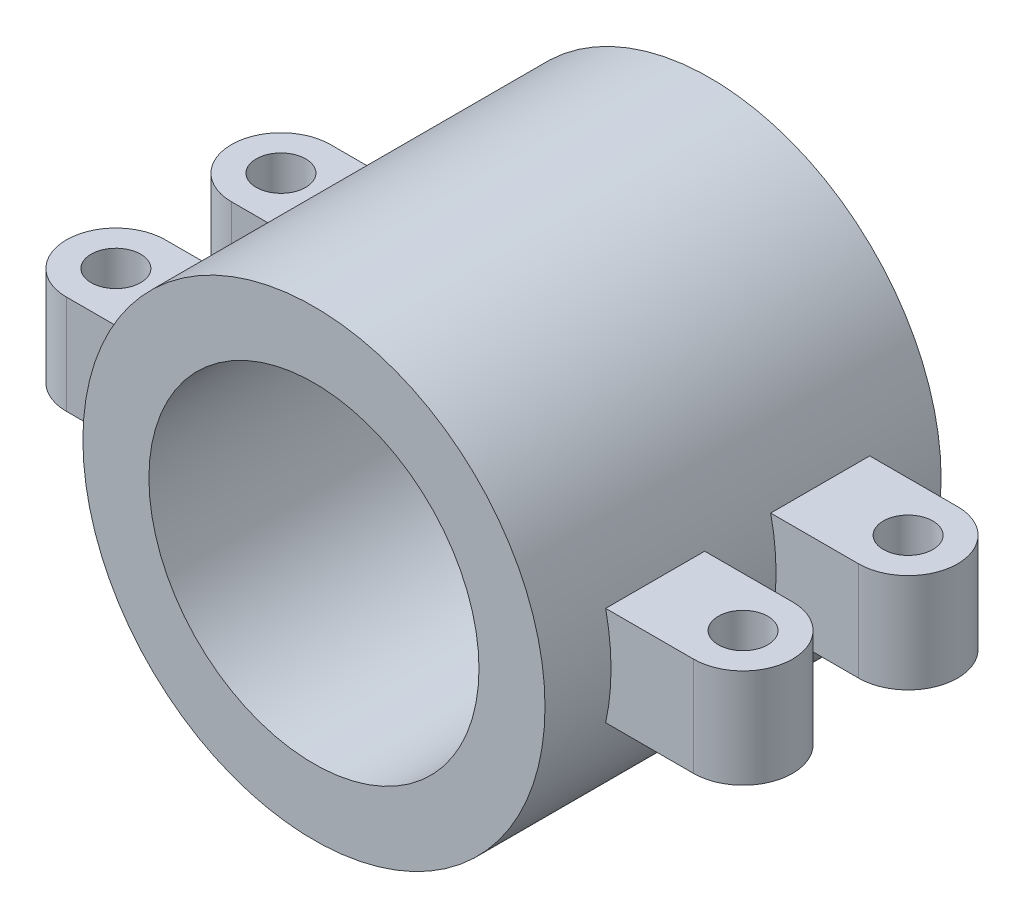
ISO-10303-21;
HEADER;
FILE_DESCRIPTION(('STEP AP214'),'2;1');
FILE_NAME('part.step','',(''),(''),'','','');
FILE_SCHEMA(('AUTOMOTIVE_DESIGN { 1 0 10303 214 1 1 1 1 }'));
ENDSEC;
DATA;
#1=APPLICATION_CONTEXT('core data for automotive mechanical design processes');
#2=APPLICATION_PROTOCOL_DEFINITION('international standard','automotive_design',2000,#1);
#3=PRODUCT_CONTEXT('',#1,'mechanical');
#4=PRODUCT('Part','Part','',(#3));
#5=PRODUCT_RELATED_PRODUCT_CATEGORY('part','',(#4));
#6=PRODUCT_DEFINITION_FORMATION('','',#4);
#7=PRODUCT_DEFINITION_CONTEXT('part definition',#1,'design');
#8=PRODUCT_DEFINITION('design','',#6,#7);
#9=PRODUCT_DEFINITION_SHAPE('','',#8);
#10=(LENGTH_UNIT() NAMED_UNIT(*) SI_UNIT(.MILLI.,.METRE.));
#11=(NAMED_UNIT(*) PLANE_ANGLE_UNIT() SI_UNIT($,.RADIAN.));
#12=(NAMED_UNIT(*) SI_UNIT($,.STERADIAN.) SOLID_ANGLE_UNIT());
#13=UNCERTAINTY_MEASURE_WITH_UNIT(LENGTH_MEASURE(1.E-05),#10,'distance_accuracy_value','');
#14=(GEOMETRIC_REPRESENTATION_CONTEXT(3) GLOBAL_UNCERTAINTY_ASSIGNED_CONTEXT((#13)) GLOBAL_UNIT_ASSIGNED_CONTEXT((#10,
#11,#12)) REPRESENTATION_CONTEXT('',''));
#15=CARTESIAN_POINT('',(0.,0.,0.));
#16=DIRECTION('',(0.,0.,1.));
#17=DIRECTION('',(1.,0.,0.));
#18=AXIS2_PLACEMENT_3D('',#15,#16,#17);
#19=CARTESIAN_POINT('',(0.,0.,120.));
#20=DIRECTION('',(0.,0.,-1.));
#21=DIRECTION('',(-1.,0.,0.));
#22=AXIS2_PLACEMENT_3D('',#19,#20,#21);
#23=CYLINDRICAL_SURFACE('',#22,70.);
#24=DIRECTION('',(0.,0.,-1.));
#25=VECTOR('',#24,1.);
#26=CARTESIAN_POINT('',(68.3739716558867,15.,120.));
#27=LINE('',#26,#25);
#28=CARTESIAN_POINT('',(68.3739716558867,15.,70.));
#29=VERTEX_POINT('',#28);
#30=CARTESIAN_POINT('',(68.3739716558867,15.,100.));
#31=VERTEX_POINT('',#30);
#32=EDGE_CURVE('E199',#29,#31,#27,.F.);
#33=ORIENTED_EDGE('',*,*,#32,.F.);
#34=CARTESIAN_POINT('',(0.,0.,70.));
#35=DIRECTION('',(0.,0.,1.));
#36=DIRECTION('',(1.,0.,0.));
#37=AXIS2_PLACEMENT_3D('',#34,#35,#36);
#38=CIRCLE('',#37,70.);
#39=CARTESIAN_POINT('',(68.3739716558867,-15.,70.));
#40=VERTEX_POINT('',#39);
#41=EDGE_CURVE('E205',#40,#29,#38,.T.);
#42=ORIENTED_EDGE('',*,*,#41,.F.);
#43=DIRECTION('',(0.,0.,-1.));
#44=VECTOR('',#43,1.);
#45=CARTESIAN_POINT('',(68.3739716558867,-15.,120.));
#46=LINE('',#45,#44);
#47=CARTESIAN_POINT('',(68.3739716558867,-15.,100.));
#48=VERTEX_POINT('',#47);
#49=EDGE_CURVE('E183',#40,#48,#46,.F.);
#50=ORIENTED_EDGE('',*,*,#49,.T.);
#51=CARTESIAN_POINT('',(0.,0.,100.));
#52=DIRECTION('',(0.,0.,-1.));
#53=DIRECTION('',(-1.,0.,0.));
#54=AXIS2_PLACEMENT_3D('',#51,#52,#53);
#55=CIRCLE('',#54,70.);
#56=EDGE_CURVE('E211',#31,#48,#55,.T.);
#57=ORIENTED_EDGE('',*,*,#56,.F.);
#58=EDGE_LOOP('',(#33,#42,#50,#57));
#59=FACE_BOUND('',#58,.T.);
#60=CARTESIAN_POINT('',(0.,0.,50.));
#61=DIRECTION('',(0.,0.,-1.));
#62=DIRECTION('',(-1.,0.,0.));
#63=AXIS2_PLACEMENT_3D('',#60,#61,#62);
#64=CIRCLE('',#63,70.);
#65=CARTESIAN_POINT('',(68.3739716558867,15.,50.));
#66=VERTEX_POINT('',#65);
#67=CARTESIAN_POINT('',(68.3739716558867,-15.,50.));
#68=VERTEX_POINT('',#67);
#69=EDGE_CURVE('E285',#66,#68,#64,.T.);
#70=ORIENTED_EDGE('',*,*,#69,.F.);
#71=DIRECTION('',(0.,0.,-1.));
#72=VECTOR('',#71,1.);
#73=CARTESIAN_POINT('',(68.3739716558867,15.,120.));
#74=LINE('',#73,#72);
#75=CARTESIAN_POINT('',(68.3739716558867,15.,20.));
#76=VERTEX_POINT('',#75);
#77=EDGE_CURVE('E273',#66,#76,#74,.T.);
#78=ORIENTED_EDGE('',*,*,#77,.T.);
#79=CARTESIAN_POINT('',(0.,0.,20.));
#80=DIRECTION('',(0.,0.,1.));
#81=DIRECTION('',(1.,0.,0.));
#82=AXIS2_PLACEMENT_3D('',#79,#80,#81);
#83=CIRCLE('',#82,70.);
#84=CARTESIAN_POINT('',(68.3739716558867,-15.,20.));
#85=VERTEX_POINT('',#84);
#86=EDGE_CURVE('E276',#85,#76,#83,.T.);
#87=ORIENTED_EDGE('',*,*,#86,.F.);
#88=DIRECTION('',(0.,0.,-1.));
#89=VECTOR('',#88,1.);
#90=CARTESIAN_POINT('',(68.3739716558867,-15.,120.));
#91=LINE('',#90,#89);
#92=EDGE_CURVE('E266',#68,#85,#91,.T.);
#93=ORIENTED_EDGE('',*,*,#92,.F.);
#94=EDGE_LOOP('',(#70,#78,#87,#93));
#95=FACE_BOUND('',#94,.T.);
#96=CARTESIAN_POINT('',(-68.3739716558867,15.,20.));
#97=VERTEX_POINT('',#96);
#98=CARTESIAN_POINT('',(-68.3739716558867,-15.,20.));
#99=VERTEX_POINT('',#98);
#100=EDGE_CURVE('E280',#97,#99,#83,.T.);
#101=ORIENTED_EDGE('',*,*,#100,.F.);
#102=DIRECTION('',(0.,0.,-1.));
#103=VECTOR('',#102,1.);
#104=CARTESIAN_POINT('',(-68.3739716558867,15.,120.));
#105=LINE('',#104,#103);
#106=CARTESIAN_POINT('',(-68.3739716558867,15.,50.));
#107=VERTEX_POINT('',#106);
#108=EDGE_CURVE('E270',#97,#107,#105,.F.);
#109=ORIENTED_EDGE('',*,*,#108,.T.);
#110=CARTESIAN_POINT('',(-68.3739716558867,-15.,50.));
#111=VERTEX_POINT('',#110);
#112=EDGE_CURVE('E281',#111,#107,#64,.T.);
#113=ORIENTED_EDGE('',*,*,#112,.F.);
#114=DIRECTION('',(0.,0.,-1.));
#115=VECTOR('',#114,1.);
#116=CARTESIAN_POINT('',(-68.3739716558867,-15.,120.));
#117=LINE('',#116,#115);
#118=EDGE_CURVE('E262',#99,#111,#117,.F.);
#119=ORIENTED_EDGE('',*,*,#118,.F.);
#120=EDGE_LOOP('',(#101,#109,#113,#119));
#121=FACE_BOUND('',#120,.T.);
#122=CARTESIAN_POINT('',(0.,0.,120.));
#123=DIRECTION('',(0.,0.,1.));
#124=DIRECTION('',(1.,0.,0.));
#125=AXIS2_PLACEMENT_3D('',#122,#123,#124);
#126=CIRCLE('',#125,70.);
#127=CARTESIAN_POINT('',(70.,0.,120.));
#128=VERTEX_POINT('',#127);
#129=EDGE_CURVE('E11',#128,#128,#126,.T.);
#130=ORIENTED_EDGE('',*,*,#129,.F.);
#131=EDGE_LOOP('',(#130));
#132=FACE_BOUND('',#131,.T.);
#133=CARTESIAN_POINT('',(0.,0.,0.));
#134=DIRECTION('',(0.,0.,1.));
#135=DIRECTION('',(1.,0.,0.));
#136=AXIS2_PLACEMENT_3D('',#133,#134,#135);
#137=CIRCLE('',#136,70.);
#138=CARTESIAN_POINT('',(70.,0.,0.));
#139=VERTEX_POINT('',#138);
#140=EDGE_CURVE('E48',#139,#139,#137,.T.);
#141=ORIENTED_EDGE('',*,*,#140,.T.);
#142=EDGE_LOOP('',(#141));
#143=FACE_BOUND('',#142,.T.);
#144=DIRECTION('',(0.,0.,-1.));
#145=VECTOR('',#144,1.);
#146=CARTESIAN_POINT('',(-68.3739716558867,15.,120.));
#147=LINE('',#146,#145);
#148=CARTESIAN_POINT('',(-68.3739716558867,15.,100.));
#149=VERTEX_POINT('',#148);
#150=CARTESIAN_POINT('',(-68.3739716558867,15.,70.));
#151=VERTEX_POINT('',#150);
#152=EDGE_CURVE('E202',#149,#151,#147,.T.);
#153=ORIENTED_EDGE('',*,*,#152,.F.);
#154=CARTESIAN_POINT('',(-68.3739716558867,-15.,100.));
#155=VERTEX_POINT('',#154);
#156=EDGE_CURVE('E162',#155,#149,#55,.T.);
#157=ORIENTED_EDGE('',*,*,#156,.F.);
#158=DIRECTION('',(0.,0.,-1.));
#159=VECTOR('',#158,1.);
#160=CARTESIAN_POINT('',(-68.3739716558867,-15.,120.));
#161=LINE('',#160,#159);
#162=CARTESIAN_POINT('',(-68.3739716558867,-15.,70.));
#163=VERTEX_POINT('',#162);
#164=EDGE_CURVE('E189',#155,#163,#161,.T.);
#165=ORIENTED_EDGE('',*,*,#164,.T.);
#166=EDGE_CURVE('E208',#151,#163,#38,.T.);
#167=ORIENTED_EDGE('',*,*,#166,.F.);
#168=EDGE_LOOP('',(#153,#157,#165,#167));
#169=FACE_BOUND('',#168,.T.);
#170=ADVANCED_FACE('F39',(#59,#95,#121,#132,#143,#169),#23,.T.);
#171=CARTESIAN_POINT('',(0.,0.,120.));
#172=DIRECTION('',(0.,0.,-1.));
#173=DIRECTION('',(-1.,0.,0.));
#174=AXIS2_PLACEMENT_3D('',#171,#172,#173);
#175=CYLINDRICAL_SURFACE('',#174,50.);
#176=CARTESIAN_POINT('',(0.,0.,120.));
#177=DIRECTION('',(0.,0.,1.));
#178=DIRECTION('',(1.,0.,0.));
#179=AXIS2_PLACEMENT_3D('',#176,#177,#178);
#180=CIRCLE('',#179,50.);
#181=CARTESIAN_POINT('',(50.,0.,120.));
#182=VERTEX_POINT('',#181);
#183=EDGE_CURVE('E286',#182,#182,#180,.T.);
#184=ORIENTED_EDGE('',*,*,#183,.T.);
#185=EDGE_LOOP('',(#184));
#186=FACE_BOUND('',#185,.T.);
#187=CARTESIAN_POINT('',(0.,0.,0.));
#188=DIRECTION('',(0.,0.,1.));
#189=DIRECTION('',(1.,0.,0.));
#190=AXIS2_PLACEMENT_3D('',#187,#188,#189);
#191=CIRCLE('',#190,50.);
#192=CARTESIAN_POINT('',(50.,0.,0.));
#193=VERTEX_POINT('',#192);
#194=EDGE_CURVE('E290',#193,#193,#191,.T.);
#195=ORIENTED_EDGE('',*,*,#194,.F.);
#196=EDGE_LOOP('',(#195));
#197=FACE_BOUND('',#196,.T.);
#198=ADVANCED_FACE('F416',(#186,#197),#175,.F.);
#199=CARTESIAN_POINT('',(0.,0.,120.));
#200=DIRECTION('',(0.,0.,1.));
#201=DIRECTION('',(1.,0.,0.));
#202=AXIS2_PLACEMENT_3D('',#199,#200,#201);
#203=PLANE('',#202);
#204=ORIENTED_EDGE('',*,*,#183,.F.);
#205=EDGE_LOOP('',(#204));
#206=FACE_BOUND('',#205,.T.);
#207=ORIENTED_EDGE('',*,*,#129,.T.);
#208=EDGE_LOOP('',(#207));
#209=FACE_BOUND('',#208,.T.);
#210=ADVANCED_FACE('F420',(#206,#209),#203,.T.);
#211=CARTESIAN_POINT('',(0.,0.,0.));
#212=DIRECTION('',(0.,0.,1.));
#213=DIRECTION('',(1.,0.,0.));
#214=AXIS2_PLACEMENT_3D('',#211,#212,#213);
#215=PLANE('',#214);
#216=ORIENTED_EDGE('',*,*,#194,.T.);
#217=EDGE_LOOP('',(#216));
#218=FACE_BOUND('',#217,.T.);
#219=ORIENTED_EDGE('',*,*,#140,.F.);
#220=EDGE_LOOP('',(#219));
#221=FACE_BOUND('',#220,.T.);
#222=ADVANCED_FACE('F426',(#218,#221),#215,.F.);
#223=CARTESIAN_POINT('',(-95.,15.,35.));
#224=DIRECTION('',(0.,-1.,0.));
#225=DIRECTION('',(0.,0.,-1.));
#226=AXIS2_PLACEMENT_3D('',#223,#224,#225);
#227=CYLINDRICAL_SURFACE('',#226,15.);
#228=CARTESIAN_POINT('',(-95.,-15.,35.));
#229=DIRECTION('',(0.,1.,0.));
#230=DIRECTION('',(0.,0.,1.));
#231=AXIS2_PLACEMENT_3D('',#228,#229,#230);
#232=CIRCLE('',#231,15.);
#233=CARTESIAN_POINT('',(-95.,-15.,20.));
#234=VERTEX_POINT('',#233);
#235=CARTESIAN_POINT('',(-95.,-15.,50.));
#236=VERTEX_POINT('',#235);
#237=EDGE_CURVE('E231',#234,#236,#232,.T.);
#238=ORIENTED_EDGE('',*,*,#237,.T.);
#239=DIRECTION('',(0.,-1.,0.));
#240=VECTOR('',#239,1.);
#241=CARTESIAN_POINT('',(-95.,15.,50.));
#242=LINE('',#241,#240);
#243=CARTESIAN_POINT('',(-95.,15.,50.));
#244=VERTEX_POINT('',#243);
#245=EDGE_CURVE('E258',#244,#236,#242,.T.);
#246=ORIENTED_EDGE('',*,*,#245,.F.);
#247=CARTESIAN_POINT('',(-95.,15.,35.));
#248=DIRECTION('',(0.,1.,0.));
#249=DIRECTION('',(0.,0.,1.));
#250=AXIS2_PLACEMENT_3D('',#247,#248,#249);
#251=CIRCLE('',#250,15.);
#252=CARTESIAN_POINT('',(-95.,15.,20.));
#253=VERTEX_POINT('',#252);
#254=EDGE_CURVE('E212',#253,#244,#251,.T.);
#255=ORIENTED_EDGE('',*,*,#254,.F.);
#256=DIRECTION('',(0.,-1.,0.));
#257=VECTOR('',#256,1.);
#258=CARTESIAN_POINT('',(-95.,15.,20.));
#259=LINE('',#258,#257);
#260=EDGE_CURVE('E230',#253,#234,#259,.T.);
#261=ORIENTED_EDGE('',*,*,#260,.T.);
#262=EDGE_LOOP('',(#238,#246,#255,#261));
#263=FACE_BOUND('',#262,.T.);
#264=ADVANCED_FACE('F431',(#263),#227,.T.);
#265=CARTESIAN_POINT('',(-95.,-15.,35.));
#266=DIRECTION('',(0.,1.,0.));
#267=DIRECTION('',(0.,0.,1.));
#268=AXIS2_PLACEMENT_3D('',#265,#266,#267);
#269=PLANE('',#268);
#270=CARTESIAN_POINT('',(-95.,-15.,35.));
#271=DIRECTION('',(0.,1.,0.));
#272=DIRECTION('',(0.,0.,1.));
#273=AXIS2_PLACEMENT_3D('',#270,#271,#272);
#274=CIRCLE('',#273,7.50000000000001);
#275=CARTESIAN_POINT('',(-95.,-15.,42.5));
#276=VERTEX_POINT('',#275);
#277=EDGE_CURVE('E322',#276,#276,#274,.T.);
#278=ORIENTED_EDGE('',*,*,#277,.T.);
#279=EDGE_LOOP('',(#278));
#280=FACE_BOUND('',#279,.T.);
#281=DIRECTION('',(-1.,0.,0.));
#282=VECTOR('',#281,1.);
#283=CARTESIAN_POINT('',(-95.,-15.,20.));
#284=LINE('',#283,#282);
#285=EDGE_CURVE('E243',#99,#234,#284,.T.);
#286=ORIENTED_EDGE('',*,*,#285,.F.);
#287=ORIENTED_EDGE('',*,*,#118,.T.);
#288=DIRECTION('',(1.,0.,0.));
#289=VECTOR('',#288,1.);
#290=CARTESIAN_POINT('',(-95.,-15.,50.));
#291=LINE('',#290,#289);
#292=EDGE_CURVE('E236',#236,#111,#291,.T.);
#293=ORIENTED_EDGE('',*,*,#292,.F.);
#294=ORIENTED_EDGE('',*,*,#237,.F.);
#295=EDGE_LOOP('',(#286,#287,#293,#294));
#296=FACE_BOUND('',#295,.T.);
#297=ADVANCED_FACE('F379',(#280,#296),#269,.F.);
#298=CARTESIAN_POINT('',(-95.,15.,35.));
#299=DIRECTION('',(0.,1.,0.));
#300=DIRECTION('',(0.,0.,1.));
#301=AXIS2_PLACEMENT_3D('',#298,#299,#300);
#302=PLANE('',#301);
#303=CARTESIAN_POINT('',(-95.,15.,35.));
#304=DIRECTION('',(0.,1.,0.));
#305=DIRECTION('',(0.,0.,1.));
#306=AXIS2_PLACEMENT_3D('',#303,#304,#305);
#307=CIRCLE('',#306,7.50000000000001);
#308=CARTESIAN_POINT('',(-95.,15.,42.5));
#309=VERTEX_POINT('',#308);
#310=EDGE_CURVE('E42',#309,#309,#307,.T.);
#311=ORIENTED_EDGE('',*,*,#310,.F.);
#312=EDGE_LOOP('',(#311));
#313=FACE_BOUND('',#312,.T.);
#314=ORIENTED_EDGE('',*,*,#108,.F.);
#315=DIRECTION('',(-1.,0.,0.));
#316=VECTOR('',#315,1.);
#317=CARTESIAN_POINT('',(-95.,15.,20.));
#318=LINE('',#317,#316);
#319=EDGE_CURVE('E225',#97,#253,#318,.T.);
#320=ORIENTED_EDGE('',*,*,#319,.T.);
#321=ORIENTED_EDGE('',*,*,#254,.T.);
#322=DIRECTION('',(1.,0.,0.));
#323=VECTOR('',#322,1.);
#324=CARTESIAN_POINT('',(-95.,15.,50.));
#325=LINE('',#324,#323);
#326=EDGE_CURVE('E218',#244,#107,#325,.T.);
#327=ORIENTED_EDGE('',*,*,#326,.T.);
#328=EDGE_LOOP('',(#314,#320,#321,#327));
#329=FACE_BOUND('',#328,.T.);
#330=ADVANCED_FACE('F375',(#313,#329),#302,.T.);
#331=CARTESIAN_POINT('',(-95.,15.,20.));
#332=DIRECTION('',(0.,0.,1.));
#333=DIRECTION('',(1.,0.,0.));
#334=AXIS2_PLACEMENT_3D('',#331,#332,#333);
#335=PLANE('',#334);
#336=ORIENTED_EDGE('',*,*,#319,.F.);
#337=ORIENTED_EDGE('',*,*,#100,.T.);
#338=ORIENTED_EDGE('',*,*,#285,.T.);
#339=ORIENTED_EDGE('',*,*,#260,.F.);
#340=EDGE_LOOP('',(#336,#337,#338,#339));
#341=FACE_BOUND('',#340,.T.);
#342=ADVANCED_FACE('F378',(#341),#335,.F.);
#343=CARTESIAN_POINT('',(-95.,15.,50.));
#344=DIRECTION('',(0.,0.,-1.));
#345=DIRECTION('',(-1.,0.,0.));
#346=AXIS2_PLACEMENT_3D('',#343,#344,#345);
#347=PLANE('',#346);
#348=ORIENTED_EDGE('',*,*,#292,.T.);
#349=ORIENTED_EDGE('',*,*,#112,.T.);
#350=ORIENTED_EDGE('',*,*,#326,.F.);
#351=ORIENTED_EDGE('',*,*,#245,.T.);
#352=EDGE_LOOP('',(#348,#349,#350,#351));
#353=FACE_BOUND('',#352,.T.);
#354=ADVANCED_FACE('F453',(#353),#347,.F.);
#355=CARTESIAN_POINT('',(95.,15.,50.));
#356=VERTEX_POINT('',#355);
#357=EDGE_CURVE('E216',#66,#356,#325,.T.);
#358=ORIENTED_EDGE('',*,*,#357,.F.);
#359=ORIENTED_EDGE('',*,*,#69,.T.);
#360=CARTESIAN_POINT('',(95.,-15.,50.));
#361=VERTEX_POINT('',#360);
#362=EDGE_CURVE('E235',#68,#361,#291,.T.);
#363=ORIENTED_EDGE('',*,*,#362,.T.);
#364=DIRECTION('',(0.,-1.,0.));
#365=VECTOR('',#364,1.);
#366=CARTESIAN_POINT('',(95.,15.,50.));
#367=LINE('',#366,#365);
#368=EDGE_CURVE('E254',#356,#361,#367,.T.);
#369=ORIENTED_EDGE('',*,*,#368,.F.);
#370=EDGE_LOOP('',(#358,#359,#363,#369));
#371=FACE_BOUND('',#370,.T.);
#372=ADVANCED_FACE('F461',(#371),#347,.F.);
#373=CARTESIAN_POINT('',(95.,15.,35.));
#374=DIRECTION('',(0.,1.,0.));
#375=DIRECTION('',(0.,0.,1.));
#376=AXIS2_PLACEMENT_3D('',#373,#374,#375);
#377=CIRCLE('',#376,7.50000000000001);
#378=CARTESIAN_POINT('',(95.,15.,42.5));
#379=VERTEX_POINT('',#378);
#380=EDGE_CURVE('E309',#379,#379,#377,.T.);
#381=ORIENTED_EDGE('',*,*,#380,.F.);
#382=EDGE_LOOP('',(#381));
#383=FACE_BOUND('',#382,.T.);
#384=ORIENTED_EDGE('',*,*,#77,.F.);
#385=ORIENTED_EDGE('',*,*,#357,.T.);
#386=CARTESIAN_POINT('',(95.,15.,35.));
#387=DIRECTION('',(0.,1.,0.));
#388=DIRECTION('',(0.,0.,1.));
#389=AXIS2_PLACEMENT_3D('',#386,#387,#388);
#390=CIRCLE('',#389,15.);
#391=CARTESIAN_POINT('',(95.,15.,20.));
#392=VERTEX_POINT('',#391);
#393=EDGE_CURVE('E222',#356,#392,#390,.T.);
#394=ORIENTED_EDGE('',*,*,#393,.T.);
#395=EDGE_CURVE('E226',#392,#76,#318,.T.);
#396=ORIENTED_EDGE('',*,*,#395,.T.);
#397=EDGE_LOOP('',(#384,#385,#394,#396));
#398=FACE_BOUND('',#397,.T.);
#399=ADVANCED_FACE('F381',(#383,#398),#302,.T.);
#400=CARTESIAN_POINT('',(95.,-15.,35.));
#401=DIRECTION('',(0.,1.,0.));
#402=DIRECTION('',(0.,0.,1.));
#403=AXIS2_PLACEMENT_3D('',#400,#401,#402);
#404=CIRCLE('',#403,7.50000000000001);
#405=CARTESIAN_POINT('',(95.,-15.,42.5));
#406=VERTEX_POINT('',#405);
#407=EDGE_CURVE('E306',#406,#406,#404,.T.);
#408=ORIENTED_EDGE('',*,*,#407,.T.);
#409=EDGE_LOOP('',(#408));
#410=FACE_BOUND('',#409,.T.);
#411=ORIENTED_EDGE('',*,*,#362,.F.);
#412=ORIENTED_EDGE('',*,*,#92,.T.);
#413=CARTESIAN_POINT('',(95.,-15.,20.));
#414=VERTEX_POINT('',#413);
#415=EDGE_CURVE('E217',#414,#85,#284,.T.);
#416=ORIENTED_EDGE('',*,*,#415,.F.);
#417=CARTESIAN_POINT('',(95.,-15.,35.));
#418=DIRECTION('',(0.,1.,0.));
#419=DIRECTION('',(0.,0.,1.));
#420=AXIS2_PLACEMENT_3D('',#417,#418,#419);
#421=CIRCLE('',#420,15.);
#422=EDGE_CURVE('E240',#361,#414,#421,.T.);
#423=ORIENTED_EDGE('',*,*,#422,.F.);
#424=EDGE_LOOP('',(#411,#412,#416,#423));
#425=FACE_BOUND('',#424,.T.);
#426=ADVANCED_FACE('F448',(#410,#425),#269,.F.);
#427=CARTESIAN_POINT('',(95.,15.,35.));
#428=DIRECTION('',(0.,-1.,0.));
#429=DIRECTION('',(0.,0.,-1.));
#430=AXIS2_PLACEMENT_3D('',#427,#428,#429);
#431=CYLINDRICAL_SURFACE('',#430,15.);
#432=ORIENTED_EDGE('',*,*,#422,.T.);
#433=DIRECTION('',(0.,-1.,0.));
#434=VECTOR('',#433,1.);
#435=CARTESIAN_POINT('',(95.,15.,20.));
#436=LINE('',#435,#434);
#437=EDGE_CURVE('E250',#392,#414,#436,.T.);
#438=ORIENTED_EDGE('',*,*,#437,.F.);
#439=ORIENTED_EDGE('',*,*,#393,.F.);
#440=ORIENTED_EDGE('',*,*,#368,.T.);
#441=EDGE_LOOP('',(#432,#438,#439,#440));
#442=FACE_BOUND('',#441,.T.);
#443=ADVANCED_FACE('F469',(#442),#431,.T.);
#444=ORIENTED_EDGE('',*,*,#415,.T.);
#445=ORIENTED_EDGE('',*,*,#86,.T.);
#446=ORIENTED_EDGE('',*,*,#395,.F.);
#447=ORIENTED_EDGE('',*,*,#437,.T.);
#448=EDGE_LOOP('',(#444,#445,#446,#447));
#449=FACE_BOUND('',#448,.T.);
#450=ADVANCED_FACE('F473',(#449),#335,.F.);
#451=CARTESIAN_POINT('',(95.,15.,85.));
#452=DIRECTION('',(0.,-1.,0.));
#453=DIRECTION('',(0.,0.,-1.));
#454=AXIS2_PLACEMENT_3D('',#451,#452,#453);
#455=CYLINDRICAL_SURFACE('',#454,15.);
#456=CARTESIAN_POINT('',(95.,-15.,85.));
#457=DIRECTION('',(0.,1.,0.));
#458=DIRECTION('',(0.,0.,-1.));
#459=AXIS2_PLACEMENT_3D('',#456,#457,#458);
#460=CIRCLE('',#459,15.);
#461=CARTESIAN_POINT('',(95.,-15.,100.));
#462=VERTEX_POINT('',#461);
#463=CARTESIAN_POINT('',(95.,-15.,70.));
#464=VERTEX_POINT('',#463);
#465=EDGE_CURVE('E338',#462,#464,#460,.T.);
#466=ORIENTED_EDGE('',*,*,#465,.T.);
#467=DIRECTION('',(0.,-1.,0.));
#468=VECTOR('',#467,1.);
#469=CARTESIAN_POINT('',(95.,15.,70.));
#470=LINE('',#469,#468);
#471=CARTESIAN_POINT('',(95.,15.,70.));
#472=VERTEX_POINT('',#471);
#473=EDGE_CURVE('E192',#472,#464,#470,.T.);
#474=ORIENTED_EDGE('',*,*,#473,.F.);
#475=CARTESIAN_POINT('',(95.,15.,85.));
#476=DIRECTION('',(0.,1.,0.));
#477=DIRECTION('',(0.,0.,-1.));
#478=AXIS2_PLACEMENT_3D('',#475,#476,#477);
#479=CIRCLE('',#478,15.);
#480=CARTESIAN_POINT('',(95.,15.,100.));
#481=VERTEX_POINT('',#480);
#482=EDGE_CURVE('E166',#481,#472,#479,.T.);
#483=ORIENTED_EDGE('',*,*,#482,.F.);
#484=DIRECTION('',(0.,-1.,0.));
#485=VECTOR('',#484,1.);
#486=CARTESIAN_POINT('',(95.,15.,100.));
#487=LINE('',#486,#485);
#488=EDGE_CURVE('E184',#481,#462,#487,.T.);
#489=ORIENTED_EDGE('',*,*,#488,.T.);
#490=EDGE_LOOP('',(#466,#474,#483,#489));
#491=FACE_BOUND('',#490,.T.);
#492=ADVANCED_FACE('F364',(#491),#455,.T.);
#493=CARTESIAN_POINT('',(-95.,15.,85.));
#494=DIRECTION('',(0.,-1.,0.));
#495=DIRECTION('',(0.,0.,-1.));
#496=AXIS2_PLACEMENT_3D('',#493,#494,#495);
#497=PLANE('',#496);
#498=CARTESIAN_POINT('',(95.,15.,85.));
#499=DIRECTION('',(0.,-1.,0.));
#500=DIRECTION('',(0.,0.,-1.));
#501=AXIS2_PLACEMENT_3D('',#498,#499,#500);
#502=CIRCLE('',#501,7.50000000000001);
#503=CARTESIAN_POINT('',(95.,15.,77.5));
#504=VERTEX_POINT('',#503);
#505=EDGE_CURVE('E305',#504,#504,#502,.T.);
#506=ORIENTED_EDGE('',*,*,#505,.T.);
#507=EDGE_LOOP('',(#506));
#508=FACE_BOUND('',#507,.T.);
#509=DIRECTION('',(-1.,0.,0.));
#510=VECTOR('',#509,1.);
#511=CARTESIAN_POINT('',(-95.,15.,70.));
#512=LINE('',#511,#510);
#513=EDGE_CURVE('E328',#472,#29,#512,.T.);
#514=ORIENTED_EDGE('',*,*,#513,.T.);
#515=ORIENTED_EDGE('',*,*,#32,.T.);
#516=DIRECTION('',(1.,0.,0.));
#517=VECTOR('',#516,1.);
#518=CARTESIAN_POINT('',(-95.,15.,100.));
#519=LINE('',#518,#517);
#520=EDGE_CURVE('E167',#31,#481,#519,.T.);
#521=ORIENTED_EDGE('',*,*,#520,.T.);
#522=ORIENTED_EDGE('',*,*,#482,.T.);
#523=EDGE_LOOP('',(#514,#515,#521,#522));
#524=FACE_BOUND('',#523,.T.);
#525=ADVANCED_FACE('F361',(#508,#524),#497,.F.);
#526=CARTESIAN_POINT('',(-95.,-15.,85.));
#527=DIRECTION('',(0.,-1.,0.));
#528=DIRECTION('',(0.,0.,-1.));
#529=AXIS2_PLACEMENT_3D('',#526,#527,#528);
#530=PLANE('',#529);
#531=CARTESIAN_POINT('',(95.,-15.,85.));
#532=DIRECTION('',(0.,-1.,0.));
#533=DIRECTION('',(0.,0.,-1.));
#534=AXIS2_PLACEMENT_3D('',#531,#532,#533);
#535=CIRCLE('',#534,7.50000000000001);
#536=CARTESIAN_POINT('',(95.,-15.,77.5));
#537=VERTEX_POINT('',#536);
#538=EDGE_CURVE('E302',#537,#537,#535,.T.);
#539=ORIENTED_EDGE('',*,*,#538,.F.);
#540=EDGE_LOOP('',(#539));
#541=FACE_BOUND('',#540,.T.);
#542=ORIENTED_EDGE('',*,*,#49,.F.);
#543=DIRECTION('',(-1.,0.,0.));
#544=VECTOR('',#543,1.);
#545=CARTESIAN_POINT('',(-95.,-15.,70.));
#546=LINE('',#545,#544);
#547=EDGE_CURVE('E178',#464,#40,#546,.T.);
#548=ORIENTED_EDGE('',*,*,#547,.F.);
#549=ORIENTED_EDGE('',*,*,#465,.F.);
#550=DIRECTION('',(1.,0.,0.));
#551=VECTOR('',#550,1.);
#552=CARTESIAN_POINT('',(-95.,-15.,100.));
#553=LINE('',#552,#551);
#554=EDGE_CURVE('E64',#48,#462,#553,.T.);
#555=ORIENTED_EDGE('',*,*,#554,.F.);
#556=EDGE_LOOP('',(#542,#548,#549,#555));
#557=FACE_BOUND('',#556,.T.);
#558=ADVANCED_FACE('F355',(#541,#557),#530,.T.);
#559=CARTESIAN_POINT('',(-95.,15.,70.));
#560=DIRECTION('',(0.,0.,1.));
#561=DIRECTION('',(1.,0.,0.));
#562=AXIS2_PLACEMENT_3D('',#559,#560,#561);
#563=PLANE('',#562);
#564=ORIENTED_EDGE('',*,*,#547,.T.);
#565=ORIENTED_EDGE('',*,*,#41,.T.);
#566=ORIENTED_EDGE('',*,*,#513,.F.);
#567=ORIENTED_EDGE('',*,*,#473,.T.);
#568=EDGE_LOOP('',(#564,#565,#566,#567));
#569=FACE_BOUND('',#568,.T.);
#570=ADVANCED_FACE('F351',(#569),#563,.F.);
#571=CARTESIAN_POINT('',(-95.,15.,100.));
#572=DIRECTION('',(0.,0.,-1.));
#573=DIRECTION('',(-1.,0.,0.));
#574=AXIS2_PLACEMENT_3D('',#571,#572,#573);
#575=PLANE('',#574);
#576=ORIENTED_EDGE('',*,*,#520,.F.);
#577=ORIENTED_EDGE('',*,*,#56,.T.);
#578=ORIENTED_EDGE('',*,*,#554,.T.);
#579=ORIENTED_EDGE('',*,*,#488,.F.);
#580=EDGE_LOOP('',(#576,#577,#578,#579));
#581=FACE_BOUND('',#580,.T.);
#582=ADVANCED_FACE('F366',(#581),#575,.F.);
#583=CARTESIAN_POINT('',(-95.,15.,70.));
#584=VERTEX_POINT('',#583);
#585=EDGE_CURVE('E173',#151,#584,#512,.T.);
#586=ORIENTED_EDGE('',*,*,#585,.F.);
#587=ORIENTED_EDGE('',*,*,#166,.T.);
#588=CARTESIAN_POINT('',(-95.,-15.,70.));
#589=VERTEX_POINT('',#588);
#590=EDGE_CURVE('E56',#163,#589,#546,.T.);
#591=ORIENTED_EDGE('',*,*,#590,.T.);
#592=DIRECTION('',(0.,-1.,0.));
#593=VECTOR('',#592,1.);
#594=CARTESIAN_POINT('',(-95.,15.,70.));
#595=LINE('',#594,#593);
#596=EDGE_CURVE('E332',#584,#589,#595,.T.);
#597=ORIENTED_EDGE('',*,*,#596,.F.);
#598=EDGE_LOOP('',(#586,#587,#591,#597));
#599=FACE_BOUND('',#598,.T.);
#600=ADVANCED_FACE('F398',(#599),#563,.F.);
#601=CARTESIAN_POINT('',(-95.,15.,85.));
#602=DIRECTION('',(0.,-1.,0.));
#603=DIRECTION('',(0.,0.,-1.));
#604=AXIS2_PLACEMENT_3D('',#601,#602,#603);
#605=CIRCLE('',#604,7.50000000000003);
#606=CARTESIAN_POINT('',(-95.,15.,77.5));
#607=VERTEX_POINT('',#606);
#608=EDGE_CURVE('E301',#607,#607,#605,.T.);
#609=ORIENTED_EDGE('',*,*,#608,.T.);
#610=EDGE_LOOP('',(#609));
#611=FACE_BOUND('',#610,.T.);
#612=CARTESIAN_POINT('',(-95.,15.,100.));
#613=VERTEX_POINT('',#612);
#614=EDGE_CURVE('E154',#613,#149,#519,.T.);
#615=ORIENTED_EDGE('',*,*,#614,.T.);
#616=ORIENTED_EDGE('',*,*,#152,.T.);
#617=ORIENTED_EDGE('',*,*,#585,.T.);
#618=CARTESIAN_POINT('',(-95.,15.,85.));
#619=DIRECTION('',(0.,1.,0.));
#620=DIRECTION('',(0.,0.,-1.));
#621=AXIS2_PLACEMENT_3D('',#618,#619,#620);
#622=CIRCLE('',#621,15.);
#623=EDGE_CURVE('E170',#584,#613,#622,.T.);
#624=ORIENTED_EDGE('',*,*,#623,.T.);
#625=EDGE_LOOP('',(#615,#616,#617,#624));
#626=FACE_BOUND('',#625,.T.);
#627=ADVANCED_FACE('F171',(#611,#626),#497,.F.);
#628=CARTESIAN_POINT('',(-95.,-15.,85.));
#629=DIRECTION('',(0.,-1.,0.));
#630=DIRECTION('',(0.,0.,-1.));
#631=AXIS2_PLACEMENT_3D('',#628,#629,#630);
#632=CIRCLE('',#631,7.50000000000003);
#633=CARTESIAN_POINT('',(-95.,-15.,77.5));
#634=VERTEX_POINT('',#633);
#635=EDGE_CURVE('E297',#634,#634,#632,.T.);
#636=ORIENTED_EDGE('',*,*,#635,.F.);
#637=EDGE_LOOP('',(#636));
#638=FACE_BOUND('',#637,.T.);
#639=ORIENTED_EDGE('',*,*,#164,.F.);
#640=CARTESIAN_POINT('',(-95.,-15.,100.));
#641=VERTEX_POINT('',#640);
#642=EDGE_CURVE('E335',#641,#155,#553,.T.);
#643=ORIENTED_EDGE('',*,*,#642,.F.);
#644=CARTESIAN_POINT('',(-95.,-15.,85.));
#645=DIRECTION('',(0.,1.,0.));
#646=DIRECTION('',(0.,0.,-1.));
#647=AXIS2_PLACEMENT_3D('',#644,#645,#646);
#648=CIRCLE('',#647,15.);
#649=EDGE_CURVE('E181',#589,#641,#648,.T.);
#650=ORIENTED_EDGE('',*,*,#649,.F.);
#651=ORIENTED_EDGE('',*,*,#590,.F.);
#652=EDGE_LOOP('',(#639,#643,#650,#651));
#653=FACE_BOUND('',#652,.T.);
#654=ADVANCED_FACE('F400',(#638,#653),#530,.T.);
#655=CARTESIAN_POINT('',(-95.,15.,85.));
#656=DIRECTION('',(0.,-1.,0.));
#657=DIRECTION('',(0.,0.,-1.));
#658=AXIS2_PLACEMENT_3D('',#655,#656,#657);
#659=CYLINDRICAL_SURFACE('',#658,15.);
#660=ORIENTED_EDGE('',*,*,#649,.T.);
#661=DIRECTION('',(0.,-1.,0.));
#662=VECTOR('',#661,1.);
#663=CARTESIAN_POINT('',(-95.,15.,100.));
#664=LINE('',#663,#662);
#665=EDGE_CURVE('E159',#613,#641,#664,.T.);
#666=ORIENTED_EDGE('',*,*,#665,.F.);
#667=ORIENTED_EDGE('',*,*,#623,.F.);
#668=ORIENTED_EDGE('',*,*,#596,.T.);
#669=EDGE_LOOP('',(#660,#666,#667,#668));
#670=FACE_BOUND('',#669,.T.);
#671=ADVANCED_FACE('F180',(#670),#659,.T.);
#672=ORIENTED_EDGE('',*,*,#642,.T.);
#673=ORIENTED_EDGE('',*,*,#156,.T.);
#674=ORIENTED_EDGE('',*,*,#614,.F.);
#675=ORIENTED_EDGE('',*,*,#665,.T.);
#676=EDGE_LOOP('',(#672,#673,#674,#675));
#677=FACE_BOUND('',#676,.T.);
#678=ADVANCED_FACE('F157',(#677),#575,.F.);
#679=CARTESIAN_POINT('',(-95.,-70.,85.));
#680=DIRECTION('',(0.,1.,0.));
#681=DIRECTION('',(0.,0.,1.));
#682=AXIS2_PLACEMENT_3D('',#679,#680,#681);
#683=CYLINDRICAL_SURFACE('',#682,7.50000000000003);
#684=ORIENTED_EDGE('',*,*,#635,.T.);
#685=EDGE_LOOP('',(#684));
#686=FACE_BOUND('',#685,.T.);
#687=ORIENTED_EDGE('',*,*,#608,.F.);
#688=EDGE_LOOP('',(#687));
#689=FACE_BOUND('',#688,.T.);
#690=ADVANCED_FACE('F511',(#686,#689),#683,.F.);
#691=CARTESIAN_POINT('',(95.,-70.,85.));
#692=DIRECTION('',(0.,1.,0.));
#693=DIRECTION('',(0.,0.,1.));
#694=AXIS2_PLACEMENT_3D('',#691,#692,#693);
#695=CYLINDRICAL_SURFACE('',#694,7.50000000000001);
#696=ORIENTED_EDGE('',*,*,#538,.T.);
#697=EDGE_LOOP('',(#696));
#698=FACE_BOUND('',#697,.T.);
#699=ORIENTED_EDGE('',*,*,#505,.F.);
#700=EDGE_LOOP('',(#699));
#701=FACE_BOUND('',#700,.T.);
#702=ADVANCED_FACE('F613',(#698,#701),#695,.F.);
#703=CARTESIAN_POINT('',(95.,-70.,35.));
#704=DIRECTION('',(0.,1.,0.));
#705=DIRECTION('',(0.,0.,1.));
#706=AXIS2_PLACEMENT_3D('',#703,#704,#705);
#707=CYLINDRICAL_SURFACE('',#706,7.50000000000001);
#708=ORIENTED_EDGE('',*,*,#380,.T.);
#709=EDGE_LOOP('',(#708));
#710=FACE_BOUND('',#709,.T.);
#711=ORIENTED_EDGE('',*,*,#407,.F.);
#712=EDGE_LOOP('',(#711));
#713=FACE_BOUND('',#712,.T.);
#714=ADVANCED_FACE('F623',(#710,#713),#707,.F.);
#715=CARTESIAN_POINT('',(-95.,-70.,35.));
#716=DIRECTION('',(0.,1.,0.));
#717=DIRECTION('',(0.,0.,1.));
#718=AXIS2_PLACEMENT_3D('',#715,#716,#717);
#719=CYLINDRICAL_SURFACE('',#718,7.50000000000001);
#720=ORIENTED_EDGE('',*,*,#310,.T.);
#721=EDGE_LOOP('',(#720));
#722=FACE_BOUND('',#721,.T.);
#723=ORIENTED_EDGE('',*,*,#277,.F.);
#724=EDGE_LOOP('',(#723));
#725=FACE_BOUND('',#724,.T.);
#726=ADVANCED_FACE('F372',(#722,#725),#719,.F.);
#727=CLOSED_SHELL('',(#170,#198,#210,#222,#264,#297,#330,#342,#354,#372,#399,#426,#443,#450,
#492,#525,#558,#570,#582,#600,#627,#654,#671,#678,#690,#702,#714,#726));
#728=MANIFOLD_SOLID_BREP('B2',#727);
#729=ADVANCED_BREP_SHAPE_REPRESENTATION('',(#18,#728),#14);
#730=SHAPE_DEFINITION_REPRESENTATION(#9,#729);
ENDSEC;
END-ISO-10303-21;
